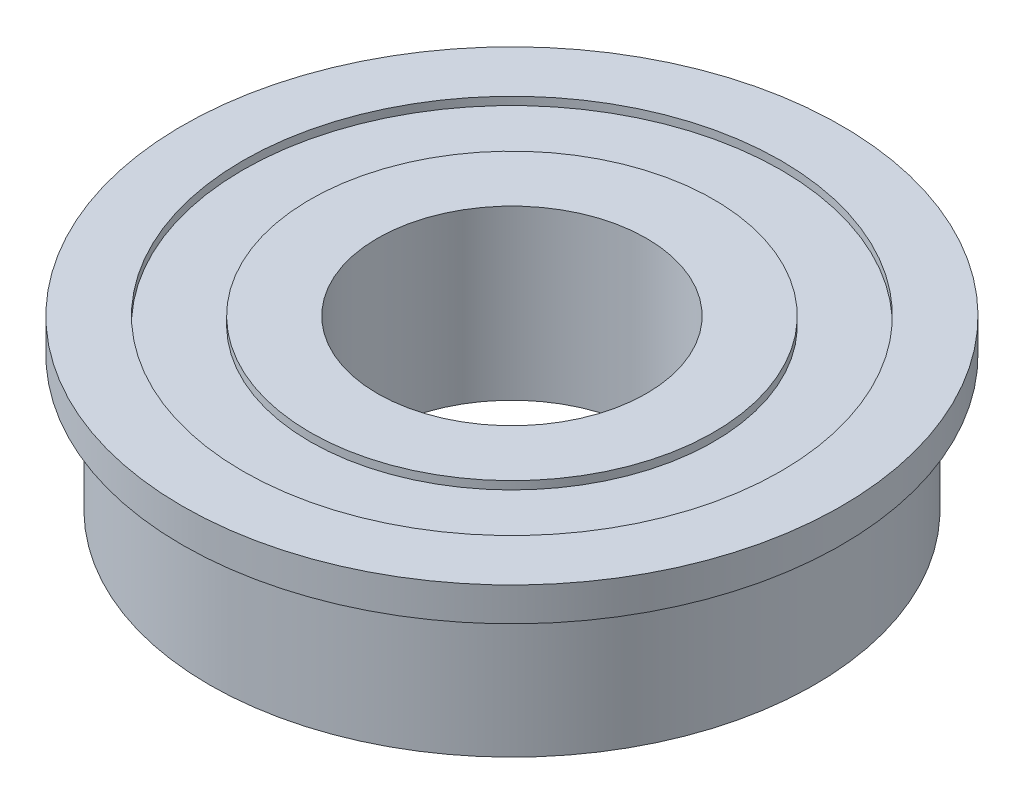
ISO-10303-21;
HEADER;
FILE_DESCRIPTION(('STEP AP214'),'2;1');
FILE_NAME('part.step','',(''),(''),'','','');
FILE_SCHEMA(('AUTOMOTIVE_DESIGN { 1 0 10303 214 1 1 1 1 }'));
ENDSEC;
DATA;
#1=APPLICATION_CONTEXT('core data for automotive mechanical design processes');
#2=APPLICATION_PROTOCOL_DEFINITION('international standard','automotive_design',2000,#1);
#3=PRODUCT_CONTEXT('',#1,'mechanical');
#4=PRODUCT('Part','Part','',(#3));
#5=PRODUCT_RELATED_PRODUCT_CATEGORY('part','',(#4));
#6=PRODUCT_DEFINITION_FORMATION('','',#4);
#7=PRODUCT_DEFINITION_CONTEXT('part definition',#1,'design');
#8=PRODUCT_DEFINITION('design','',#6,#7);
#9=PRODUCT_DEFINITION_SHAPE('','',#8);
#10=(LENGTH_UNIT() NAMED_UNIT(*) SI_UNIT(.MILLI.,.METRE.));
#11=(NAMED_UNIT(*) PLANE_ANGLE_UNIT() SI_UNIT($,.RADIAN.));
#12=(NAMED_UNIT(*) SI_UNIT($,.STERADIAN.) SOLID_ANGLE_UNIT());
#13=UNCERTAINTY_MEASURE_WITH_UNIT(LENGTH_MEASURE(1.E-05),#10,'distance_accuracy_value','');
#14=(GEOMETRIC_REPRESENTATION_CONTEXT(3) GLOBAL_UNCERTAINTY_ASSIGNED_CONTEXT((#13)) GLOBAL_UNIT_ASSIGNED_CONTEXT((#10,
#11,#12)) REPRESENTATION_CONTEXT('',''));
#15=CARTESIAN_POINT('',(0.,0.,0.));
#16=DIRECTION('',(0.,0.,1.));
#17=DIRECTION('',(1.,0.,0.));
#18=AXIS2_PLACEMENT_3D('',#15,#16,#17);
#19=CARTESIAN_POINT('',(0.,0.,0.));
#20=DIRECTION('',(0.,1.,0.));
#21=DIRECTION('',(0.,0.,1.));
#22=AXIS2_PLACEMENT_3D('',#19,#20,#21);
#23=CYLINDRICAL_SURFACE('',#22,9.525);
#24=CARTESIAN_POINT('',(0.,7.5565,0.));
#25=DIRECTION('',(0.,1.,0.));
#26=DIRECTION('',(0.,0.,1.));
#27=AXIS2_PLACEMENT_3D('',#24,#25,#26);
#28=CIRCLE('',#27,9.525);
#29=CARTESIAN_POINT('',(0.,7.5565,9.525));
#30=VERTEX_POINT('',#29);
#31=EDGE_CURVE('E66',#30,#30,#28,.T.);
#32=ORIENTED_EDGE('',*,*,#31,.T.);
#33=EDGE_LOOP('',(#32));
#34=FACE_BOUND('',#33,.T.);
#35=CARTESIAN_POINT('',(0.,7.9375,0.));
#36=DIRECTION('',(0.,1.,0.));
#37=DIRECTION('',(0.,0.,1.));
#38=AXIS2_PLACEMENT_3D('',#35,#36,#37);
#39=CIRCLE('',#38,9.525);
#40=CARTESIAN_POINT('',(0.,7.9375,9.525));
#41=VERTEX_POINT('',#40);
#42=EDGE_CURVE('E10',#41,#41,#39,.T.);
#43=ORIENTED_EDGE('',*,*,#42,.F.);
#44=EDGE_LOOP('',(#43));
#45=FACE_BOUND('',#44,.T.);
#46=ADVANCED_FACE('F32',(#34,#45),#23,.T.);
#47=CARTESIAN_POINT('',(6.35,7.9375,0.));
#48=DIRECTION('',(0.,1.,0.));
#49=DIRECTION('',(0.,0.,1.));
#50=AXIS2_PLACEMENT_3D('',#47,#48,#49);
#51=PLANE('',#50);
#52=ORIENTED_EDGE('',*,*,#42,.T.);
#53=EDGE_LOOP('',(#52));
#54=FACE_BOUND('',#53,.T.);
#55=CARTESIAN_POINT('',(0.,7.9375,0.));
#56=DIRECTION('',(0.,1.,0.));
#57=DIRECTION('',(0.,0.,1.));
#58=AXIS2_PLACEMENT_3D('',#55,#56,#57);
#59=CIRCLE('',#58,6.35);
#60=CARTESIAN_POINT('',(0.,7.9375,6.35));
#61=VERTEX_POINT('',#60);
#62=EDGE_CURVE('E38',#61,#61,#59,.T.);
#63=ORIENTED_EDGE('',*,*,#62,.F.);
#64=EDGE_LOOP('',(#63));
#65=FACE_BOUND('',#64,.T.);
#66=ADVANCED_FACE('F84',(#54,#65),#51,.T.);
#67=CARTESIAN_POINT('',(0.,0.,0.));
#68=DIRECTION('',(0.,1.,0.));
#69=DIRECTION('',(0.,0.,1.));
#70=AXIS2_PLACEMENT_3D('',#67,#68,#69);
#71=CYLINDRICAL_SURFACE('',#70,6.35);
#72=ORIENTED_EDGE('',*,*,#62,.T.);
#73=EDGE_LOOP('',(#72));
#74=FACE_BOUND('',#73,.T.);
#75=CARTESIAN_POINT('',(0.,0.,0.));
#76=DIRECTION('',(0.,1.,0.));
#77=DIRECTION('',(0.,0.,1.));
#78=AXIS2_PLACEMENT_3D('',#75,#76,#77);
#79=CIRCLE('',#78,6.35);
#80=CARTESIAN_POINT('',(0.,0.,6.35));
#81=VERTEX_POINT('',#80);
#82=EDGE_CURVE('E42',#81,#81,#79,.T.);
#83=ORIENTED_EDGE('',*,*,#82,.F.);
#84=EDGE_LOOP('',(#83));
#85=FACE_BOUND('',#84,.T.);
#86=ADVANCED_FACE('F88',(#74,#85),#71,.F.);
#87=CARTESIAN_POINT('',(14.2875,0.,0.));
#88=DIRECTION('',(0.,-1.,0.));
#89=DIRECTION('',(0.,0.,-1.));
#90=AXIS2_PLACEMENT_3D('',#87,#88,#89);
#91=PLANE('',#90);
#92=ORIENTED_EDGE('',*,*,#82,.T.);
#93=EDGE_LOOP('',(#92));
#94=FACE_BOUND('',#93,.T.);
#95=CARTESIAN_POINT('',(0.,0.,0.));
#96=DIRECTION('',(0.,1.,0.));
#97=DIRECTION('',(0.,0.,1.));
#98=AXIS2_PLACEMENT_3D('',#95,#96,#97);
#99=CIRCLE('',#98,14.2875);
#100=CARTESIAN_POINT('',(0.,0.,14.2875));
#101=VERTEX_POINT('',#100);
#102=EDGE_CURVE('E46',#101,#101,#99,.T.);
#103=ORIENTED_EDGE('',*,*,#102,.F.);
#104=EDGE_LOOP('',(#103));
#105=FACE_BOUND('',#104,.T.);
#106=ADVANCED_FACE('F92',(#94,#105),#91,.T.);
#107=CARTESIAN_POINT('',(0.,0.,0.));
#108=DIRECTION('',(0.,1.,0.));
#109=DIRECTION('',(0.,0.,1.));
#110=AXIS2_PLACEMENT_3D('',#107,#108,#109);
#111=CYLINDRICAL_SURFACE('',#110,14.2875);
#112=ORIENTED_EDGE('',*,*,#102,.T.);
#113=EDGE_LOOP('',(#112));
#114=FACE_BOUND('',#113,.T.);
#115=CARTESIAN_POINT('',(0.,6.35,0.));
#116=DIRECTION('',(0.,1.,0.));
#117=DIRECTION('',(0.,0.,1.));
#118=AXIS2_PLACEMENT_3D('',#115,#116,#117);
#119=CIRCLE('',#118,14.2875);
#120=CARTESIAN_POINT('',(0.,6.35,14.2875));
#121=VERTEX_POINT('',#120);
#122=EDGE_CURVE('E51',#121,#121,#119,.T.);
#123=ORIENTED_EDGE('',*,*,#122,.F.);
#124=EDGE_LOOP('',(#123));
#125=FACE_BOUND('',#124,.T.);
#126=ADVANCED_FACE('F98',(#114,#125),#111,.T.);
#127=CARTESIAN_POINT('',(15.5575,6.35,0.));
#128=DIRECTION('',(0.,-1.,0.));
#129=DIRECTION('',(0.,0.,-1.));
#130=AXIS2_PLACEMENT_3D('',#127,#128,#129);
#131=PLANE('',#130);
#132=ORIENTED_EDGE('',*,*,#122,.T.);
#133=EDGE_LOOP('',(#132));
#134=FACE_BOUND('',#133,.T.);
#135=CARTESIAN_POINT('',(0.,6.35,0.));
#136=DIRECTION('',(0.,1.,0.));
#137=DIRECTION('',(0.,0.,1.));
#138=AXIS2_PLACEMENT_3D('',#135,#136,#137);
#139=CIRCLE('',#138,15.5575);
#140=CARTESIAN_POINT('',(0.,6.35,15.5575));
#141=VERTEX_POINT('',#140);
#142=EDGE_CURVE('E54',#141,#141,#139,.T.);
#143=ORIENTED_EDGE('',*,*,#142,.F.);
#144=EDGE_LOOP('',(#143));
#145=FACE_BOUND('',#144,.T.);
#146=ADVANCED_FACE('F102',(#134,#145),#131,.T.);
#147=CARTESIAN_POINT('',(0.,0.,0.));
#148=DIRECTION('',(0.,1.,0.));
#149=DIRECTION('',(0.,0.,1.));
#150=AXIS2_PLACEMENT_3D('',#147,#148,#149);
#151=CYLINDRICAL_SURFACE('',#150,15.5575);
#152=ORIENTED_EDGE('',*,*,#142,.T.);
#153=EDGE_LOOP('',(#152));
#154=FACE_BOUND('',#153,.T.);
#155=CARTESIAN_POINT('',(0.,7.9375,0.));
#156=DIRECTION('',(0.,1.,0.));
#157=DIRECTION('',(0.,0.,1.));
#158=AXIS2_PLACEMENT_3D('',#155,#156,#157);
#159=CIRCLE('',#158,15.5575);
#160=CARTESIAN_POINT('',(0.,7.9375,15.5575));
#161=VERTEX_POINT('',#160);
#162=EDGE_CURVE('E57',#161,#161,#159,.T.);
#163=ORIENTED_EDGE('',*,*,#162,.F.);
#164=EDGE_LOOP('',(#163));
#165=FACE_BOUND('',#164,.T.);
#166=ADVANCED_FACE('F106',(#154,#165),#151,.T.);
#167=CARTESIAN_POINT('',(12.7,7.9375,0.));
#168=DIRECTION('',(0.,1.,0.));
#169=DIRECTION('',(0.,0.,1.));
#170=AXIS2_PLACEMENT_3D('',#167,#168,#169);
#171=PLANE('',#170);
#172=ORIENTED_EDGE('',*,*,#162,.T.);
#173=EDGE_LOOP('',(#172));
#174=FACE_BOUND('',#173,.T.);
#175=CARTESIAN_POINT('',(0.,7.9375,0.));
#176=DIRECTION('',(0.,1.,0.));
#177=DIRECTION('',(0.,0.,1.));
#178=AXIS2_PLACEMENT_3D('',#175,#176,#177);
#179=CIRCLE('',#178,12.7);
#180=CARTESIAN_POINT('',(0.,7.9375,12.7));
#181=VERTEX_POINT('',#180);
#182=EDGE_CURVE('E60',#181,#181,#179,.T.);
#183=ORIENTED_EDGE('',*,*,#182,.F.);
#184=EDGE_LOOP('',(#183));
#185=FACE_BOUND('',#184,.T.);
#186=ADVANCED_FACE('F80',(#174,#185),#171,.T.);
#187=CARTESIAN_POINT('',(0.,0.,0.));
#188=DIRECTION('',(0.,1.,0.));
#189=DIRECTION('',(0.,0.,1.));
#190=AXIS2_PLACEMENT_3D('',#187,#188,#189);
#191=CYLINDRICAL_SURFACE('',#190,12.7);
#192=ORIENTED_EDGE('',*,*,#182,.T.);
#193=EDGE_LOOP('',(#192));
#194=FACE_BOUND('',#193,.T.);
#195=CARTESIAN_POINT('',(0.,7.5565,0.));
#196=DIRECTION('',(0.,1.,0.));
#197=DIRECTION('',(0.,0.,1.));
#198=AXIS2_PLACEMENT_3D('',#195,#196,#197);
#199=CIRCLE('',#198,12.7);
#200=CARTESIAN_POINT('',(0.,7.5565,12.7));
#201=VERTEX_POINT('',#200);
#202=EDGE_CURVE('E63',#201,#201,#199,.T.);
#203=ORIENTED_EDGE('',*,*,#202,.F.);
#204=EDGE_LOOP('',(#203));
#205=FACE_BOUND('',#204,.T.);
#206=ADVANCED_FACE('F74',(#194,#205),#191,.F.);
#207=CARTESIAN_POINT('',(9.525,7.5565,0.));
#208=DIRECTION('',(0.,1.,0.));
#209=DIRECTION('',(0.,0.,1.));
#210=AXIS2_PLACEMENT_3D('',#207,#208,#209);
#211=PLANE('',#210);
#212=ORIENTED_EDGE('',*,*,#202,.T.);
#213=EDGE_LOOP('',(#212));
#214=FACE_BOUND('',#213,.T.);
#215=ORIENTED_EDGE('',*,*,#31,.F.);
#216=EDGE_LOOP('',(#215));
#217=FACE_BOUND('',#216,.T.);
#218=ADVANCED_FACE('F72',(#214,#217),#211,.T.);
#219=CLOSED_SHELL('',(#46,#66,#86,#106,#126,#146,#166,#186,#206,#218));
#220=MANIFOLD_SOLID_BREP('B2',#219);
#221=ADVANCED_BREP_SHAPE_REPRESENTATION('',(#18,#220),#14);
#222=SHAPE_DEFINITION_REPRESENTATION(#9,#221);
ENDSEC;
END-ISO-10303-21;
